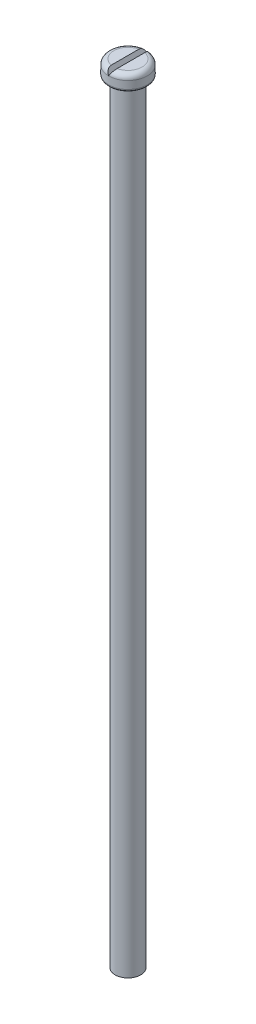
ISO-10303-21;
HEADER;
FILE_DESCRIPTION(('STEP AP214'),'2;1');
FILE_NAME('part.step','',(''),(''),'','','');
FILE_SCHEMA(('AUTOMOTIVE_DESIGN { 1 0 10303 214 1 1 1 1 }'));
ENDSEC;
DATA;
#1=APPLICATION_CONTEXT('core data for automotive mechanical design processes');
#2=APPLICATION_PROTOCOL_DEFINITION('international standard','automotive_design',2000,#1);
#3=PRODUCT_CONTEXT('',#1,'mechanical');
#4=PRODUCT('Part','Part','',(#3));
#5=PRODUCT_RELATED_PRODUCT_CATEGORY('part','',(#4));
#6=PRODUCT_DEFINITION_FORMATION('','',#4);
#7=PRODUCT_DEFINITION_CONTEXT('part definition',#1,'design');
#8=PRODUCT_DEFINITION('design','',#6,#7);
#9=PRODUCT_DEFINITION_SHAPE('','',#8);
#10=(LENGTH_UNIT() NAMED_UNIT(*) SI_UNIT(.MILLI.,.METRE.));
#11=(NAMED_UNIT(*) PLANE_ANGLE_UNIT() SI_UNIT($,.RADIAN.));
#12=(NAMED_UNIT(*) SI_UNIT($,.STERADIAN.) SOLID_ANGLE_UNIT());
#13=UNCERTAINTY_MEASURE_WITH_UNIT(LENGTH_MEASURE(1.E-05),#10,'distance_accuracy_value','');
#14=(GEOMETRIC_REPRESENTATION_CONTEXT(3) GLOBAL_UNCERTAINTY_ASSIGNED_CONTEXT((#13)) GLOBAL_UNIT_ASSIGNED_CONTEXT((#10,
#11,#12)) REPRESENTATION_CONTEXT('',''));
#15=CARTESIAN_POINT('',(0.,0.,0.));
#16=DIRECTION('',(0.,0.,1.));
#17=DIRECTION('',(1.,0.,0.));
#18=AXIS2_PLACEMENT_3D('',#15,#16,#17);
#19=CARTESIAN_POINT('',(0.,153.,0.));
#20=DIRECTION('',(0.,1.,0.));
#21=DIRECTION('',(0.,0.,1.));
#22=AXIS2_PLACEMENT_3D('',#19,#20,#21);
#23=PLANE('',#22);
#24=CARTESIAN_POINT('',(0.,153.,0.));
#25=DIRECTION('',(0.,1.,0.));
#26=DIRECTION('',(0.,0.,1.));
#27=AXIS2_PLACEMENT_3D('',#24,#25,#26);
#28=CIRCLE('',#27,2.75);
#29=CARTESIAN_POINT('',(0.577350269189633,153.,2.68871096748361));
#30=VERTEX_POINT('',#29);
#31=CARTESIAN_POINT('',(0.577350269189633,153.,-2.68871096748361));
#32=VERTEX_POINT('',#31);
#33=EDGE_CURVE('E86',#30,#32,#28,.T.);
#34=ORIENTED_EDGE('',*,*,#33,.T.);
#35=DIRECTION('',(0.,0.,-1.));
#36=VECTOR('',#35,1.);
#37=CARTESIAN_POINT('',(0.577350269189633,153.,10.));
#38=LINE('',#37,#36);
#39=EDGE_CURVE('E55',#30,#32,#38,.T.);
#40=ORIENTED_EDGE('',*,*,#39,.F.);
#41=EDGE_LOOP('',(#34,#40));
#42=FACE_BOUND('',#41,.T.);
#43=ADVANCED_FACE('F33',(#42),#23,.T.);
#44=CARTESIAN_POINT('',(-0.577350269189633,153.,-2.68871096748362));
#45=VERTEX_POINT('',#44);
#46=CARTESIAN_POINT('',(-0.577350269189633,153.,2.68871096748361));
#47=VERTEX_POINT('',#46);
#48=EDGE_CURVE('E79',#45,#47,#28,.T.);
#49=ORIENTED_EDGE('',*,*,#48,.T.);
#50=DIRECTION('',(0.,0.,-1.));
#51=VECTOR('',#50,1.);
#52=CARTESIAN_POINT('',(-0.577350269189633,153.,10.));
#53=LINE('',#52,#51);
#54=EDGE_CURVE('E66',#47,#45,#53,.T.);
#55=ORIENTED_EDGE('',*,*,#54,.T.);
#56=EDGE_LOOP('',(#49,#55));
#57=FACE_BOUND('',#56,.T.);
#58=ADVANCED_FACE('F85',(#57),#23,.T.);
#59=CARTESIAN_POINT('',(0.,152.,0.));
#60=DIRECTION('',(0.,1.,0.));
#61=DIRECTION('',(0.,0.,1.));
#62=AXIS2_PLACEMENT_3D('',#59,#60,#61);
#63=TOROIDAL_SURFACE('',#62,2.75,1.);
#64=ORIENTED_EDGE('',*,*,#33,.F.);
#65=CARTESIAN_POINT('',(-0.000115470053841142,151.9998,1.75000001619048));
#66=CARTESIAN_POINT('',(0.0209484655551252,152.036283806682,1.75001085956885));
#67=CARTESIAN_POINT('',(0.0420172013686741,152.072775927562,1.75160544013414));
#68=CARTESIAN_POINT('',(0.08406750960041,152.145609197894,1.75808927161738));
#69=CARTESIAN_POINT('',(0.105048835581679,152.181949920503,1.76298487009));
#70=CARTESIAN_POINT('',(0.146971876057755,152.254562756616,1.77627065487943));
#71=CARTESIAN_POINT('',(0.167910680972026,152.290829830577,1.78469824833808));
#72=CARTESIAN_POINT('',(0.209309329480201,152.362534393158,1.80526918971544));
#73=CARTESIAN_POINT('',(0.229769554863219,152.397972543056,1.8174094588678));
#74=CARTESIAN_POINT('',(0.277689771058094,152.480972792215,1.85109292101));
#75=CARTESIAN_POINT('',(0.304841154419377,152.528000367692,1.87445642646166));
#76=CARTESIAN_POINT('',(0.356892937282951,152.618156700237,1.92941289798607));
#77=CARTESIAN_POINT('',(0.38180073627445,152.661298273595,1.96097737007163));
#78=CARTESIAN_POINT('',(0.428665053750137,152.742469652524,2.03303956886826));
#79=CARTESIAN_POINT('',(0.450583856027887,152.780434131711,2.0736369754288));
#80=CARTESIAN_POINT('',(0.489901599435792,152.848534460932,2.16285510950786));
#81=CARTESIAN_POINT('',(0.507302879597329,152.878674362289,2.21147166355223));
#82=CARTESIAN_POINT('',(0.534369747704999,152.925555553053,2.30697260930815));
#83=CARTESIAN_POINT('',(0.544811559085812,152.943641300887,2.35298390736476));
#84=CARTESIAN_POINT('',(0.561444100561424,152.972449707782,2.44797834834081));
#85=CARTESIAN_POINT('',(0.56763549302068,152.983173514091,2.49696102691945));
#86=CARTESIAN_POINT('',(0.575488929232366,152.996776064624,2.59377396776612));
#87=CARTESIAN_POINT('',(0.577365189618826,153.000025842941,2.64153626462796));
#88=CARTESIAN_POINT('',(0.577335164292318,152.99997383755,2.73704202890096));
#89=CARTESIAN_POINT('',(0.575428632668017,152.996671627911,2.78478549488616));
#90=CARTESIAN_POINT('',(0.567810163854552,152.98347605285,2.8821588327198));
#91=CARTESIAN_POINT('',(0.56186307914217,152.973175399971,2.93171457498444));
#92=CARTESIAN_POINT('',(0.546264204560442,152.946157356655,3.02843011891978));
#93=CARTESIAN_POINT('',(0.536610946898149,152.929437423925,3.0755889629328));
#94=CARTESIAN_POINT('',(0.512874483672331,152.888324663626,3.17098620294368));
#95=CARTESIAN_POINT('',(0.498453199871364,152.863346267372,3.21888811224706));
#96=CARTESIAN_POINT('',(0.466115657353585,152.80733600074,3.30970515485604));
#97=CARTESIAN_POINT('',(0.448198176296832,152.776302013206,3.35261853567545));
#98=CARTESIAN_POINT('',(0.407614269888646,152.706008625337,3.43632760476896));
#99=CARTESIAN_POINT('',(0.384663696646262,152.666257066419,3.4765727477869));
#100=CARTESIAN_POINT('',(0.335893467218433,152.581784551153,3.54939048999603));
#101=CARTESIAN_POINT('',(0.310072432553336,152.537061207209,3.58195937919646));
#102=CARTESIAN_POINT('',(0.254374891317378,152.440590235932,3.6407859698484));
#103=CARTESIAN_POINT('',(0.224341288931661,152.388570510665,3.66644859373228));
#104=CARTESIAN_POINT('',(0.162612009472907,152.281652262328,3.70776295620746));
#105=CARTESIAN_POINT('',(0.130917397631563,152.226755584293,3.72342102788772));
#106=CARTESIAN_POINT('',(0.0824635065171768,152.142830983058,3.73929371903051));
#107=CARTESIAN_POINT('',(0.0659947762769646,152.114306305546,3.74331612080812));
#108=CARTESIAN_POINT('',(0.0329810075382238,152.057124780741,3.74866943119802));
#109=CARTESIAN_POINT('',(0.0164361839319631,152.028468305653,3.75000563878057));
#110=CARTESIAN_POINT('',(-0.000115470053837213,151.9998,3.7499999782223));
#111=B_SPLINE_CURVE_WITH_KNOTS('',3,(#65,#66,#67,#68,#69,#70,#71,#72,#73,#74,#75,#76,#77,#78,
#79,#80,#81,#82,#83,#84,#85,#86,#87,#88,#89,#90,#91,#92,#93,#94,#95,#96,#97,#98,#99,#100,#101,
#102,#103,#104,#105,#106,#107,#108,#109,#110),.UNSPECIFIED.,.F.,.F.,(4,2,2,2,2,2,2,2,2,2,2,2,2,
2,2,2,2,2,2,2,2,2,4),(0.,0.126368028671535,0.25297974706964,0.380967713199966,0.508849830759628,
0.685536653031699,0.861617606551809,1.03974757158058,1.21778512171644,1.36858225517138,
1.5193558838023,1.66246621191694,1.8055858436371,1.9578414526995,2.11015742338722,
2.27720049589411,2.44430207495475,2.62665141889002,2.8090887137285,3.00419082232551,
3.19916930456234,3.29862059646818,3.39787551068638),.UNSPECIFIED.);
#112=CARTESIAN_POINT('',(0.,152.,3.75));
#113=VERTEX_POINT('',#112);
#114=EDGE_CURVE('E82',#30,#113,#111,.T.);
#115=ORIENTED_EDGE('',*,*,#114,.T.);
#116=CARTESIAN_POINT('',(0.,152.,0.));
#117=DIRECTION('',(0.,1.,0.));
#118=DIRECTION('',(0.,0.,1.));
#119=AXIS2_PLACEMENT_3D('',#116,#117,#118);
#120=CIRCLE('',#119,3.75);
#121=CARTESIAN_POINT('',(0.,152.,-3.75));
#122=VERTEX_POINT('',#121);
#123=EDGE_CURVE('E90',#122,#113,#120,.F.);
#124=ORIENTED_EDGE('',*,*,#123,.F.);
#125=CARTESIAN_POINT('',(-0.000115470053841247,151.9998,-3.74999997822222));
#126=CARTESIAN_POINT('',(0.0340384252611943,152.058956281962,-3.75005660942029));
#127=CARTESIAN_POINT('',(0.0681930814106098,152.118113881728,-3.74431173427567));
#128=CARTESIAN_POINT('',(0.135570303553001,152.234814653751,-3.72152223450687));
#129=CARTESIAN_POINT('',(0.16879222068131,152.292356702142,-3.70446993736152));
#130=CARTESIAN_POINT('',(0.233349820905158,152.404173745745,-3.65934972519742));
#131=CARTESIAN_POINT('',(0.264683814013755,152.458445813813,-3.63127210493293));
#132=CARTESIAN_POINT('',(0.324457401550758,152.561976704378,-3.56474977822805));
#133=CARTESIAN_POINT('',(0.35289844015485,152.61123802826,-3.52631027981403));
#134=CARTESIAN_POINT('',(0.405271378137289,152.701950617787,-3.44104873225281));
#135=CARTESIAN_POINT('',(0.429298515404751,152.743566840295,-3.394461224206));
#136=CARTESIAN_POINT('',(0.472808848314608,152.818928947549,-3.2934135467998));
#137=CARTESIAN_POINT('',(0.492292264601939,152.852675214464,-3.23895375992961));
#138=CARTESIAN_POINT('',(0.524803809009096,152.908986861209,-3.12717807079762));
#139=CARTESIAN_POINT('',(0.538151419703191,152.932105601091,-3.07023488078048));
#140=CARTESIAN_POINT('',(0.559329068204868,152.968786364281,-2.95236595258503));
#141=CARTESIAN_POINT('',(0.567162654739825,152.982354534165,-2.89144280348183));
#142=CARTESIAN_POINT('',(0.576240209108803,152.998077319541,-2.77346020141678));
#143=CARTESIAN_POINT('',(0.578030147594193,153.00117758394,-2.71656964442777));
#144=CARTESIAN_POINT('',(0.576209336298232,152.998023846264,-2.60313786456695));
#145=CARTESIAN_POINT('',(0.572603672358546,152.991778653126,-2.54659636310586));
#146=CARTESIAN_POINT('',(0.560569012048558,152.970934010017,-2.44187821523171));
#147=CARTESIAN_POINT('',(0.552688634646429,152.957284795973,-2.39344815875947));
#148=CARTESIAN_POINT('',(0.532705027374284,152.92267217286,-2.30022211374278));
#149=CARTESIAN_POINT('',(0.520603864134791,152.901712343298,-2.25542435991365));
#150=CARTESIAN_POINT('',(0.493468898616936,152.85471320436,-2.17341750325088));
#151=CARTESIAN_POINT('',(0.478656306784737,152.829057042714,-2.13591350893716));
#152=CARTESIAN_POINT('',(0.446239078395953,152.772908756104,-2.06612827244175));
#153=CARTESIAN_POINT('',(0.42863449498769,152.742416723195,-2.03384693086532));
#154=CARTESIAN_POINT('',(0.390238415727691,152.675912763106,-1.97325037486977));
#155=CARTESIAN_POINT('',(0.369326139560134,152.639691638281,-1.94524359133165));
#156=CARTESIAN_POINT('',(0.325754050068556,152.56422256549,-1.8953069834418));
#157=CARTESIAN_POINT('',(0.303092119624438,152.524970950563,-1.87338467353986));
#158=CARTESIAN_POINT('',(0.243514128332367,152.421778842633,-1.82453894685715));
#159=CARTESIAN_POINT('',(0.205752669469103,152.356374077313,-1.80174256517128));
#160=CARTESIAN_POINT('',(0.128930463973443,152.223314114245,-1.76845680614801));
#161=CARTESIAN_POINT('',(0.0898690065927526,152.155657685444,-1.75797427872601));
#162=CARTESIAN_POINT('',(0.0422141394206663,152.073117034274,-1.75208078392321));
#163=CARTESIAN_POINT('',(0.03374071955033,152.058440640545,-1.75129675458104));
#164=CARTESIAN_POINT('',(0.0168070964070089,152.029110744905,-1.75025564539774));
#165=CARTESIAN_POINT('',(0.00834691341939388,152.014457278129,-1.74999724650461));
#166=CARTESIAN_POINT('',(-0.000115470053839954,151.9998,-1.75000001619048));
#167=B_SPLINE_CURVE_WITH_KNOTS('',3,(#125,#126,#127,#128,#129,#130,#131,#132,#133,#134,#135,
#136,#137,#138,#139,#140,#141,#142,#143,#144,#145,#146,#147,#148,#149,#150,#151,#152,#153,#154,
#155,#156,#157,#158,#159,#160,#161,#162,#163,#164,#165,#166),.UNSPECIFIED.,.F.,.F.,(4,2,2,2,2,2,
2,2,2,2,2,2,2,2,2,2,2,2,2,2,4),(0.,0.204685243967307,0.409509517067552,0.614514496191856,
0.819416628419386,1.0191772708235,1.21892821074888,1.40658194027588,1.594114788521,
1.76417459842209,1.93407421256061,2.08606081358211,2.2379731013719,2.38071223540546,
2.52344865258449,2.67389528043641,2.82452689444772,3.05991791196452,3.29543981020444,
3.34633105855997,3.39709443869585),.UNSPECIFIED.);
#168=EDGE_CURVE('E83',#122,#32,#167,.T.);
#169=ORIENTED_EDGE('',*,*,#168,.T.);
#170=EDGE_LOOP('',(#64,#115,#124,#169));
#171=FACE_BOUND('',#170,.T.);
#172=ADVANCED_FACE('F106',(#171),#63,.T.);
#173=EDGE_CURVE('E81',#113,#122,#120,.F.);
#174=ORIENTED_EDGE('',*,*,#173,.F.);
#175=CARTESIAN_POINT('',(0.000115470053841247,151.9998,3.74999997822222));
#176=CARTESIAN_POINT('',(-0.0340384252611942,152.058956281962,3.75005660942029));
#177=CARTESIAN_POINT('',(-0.0681930814106097,152.118113881728,3.74431173427567));
#178=CARTESIAN_POINT('',(-0.135570303553001,152.234814653751,3.72152223450687));
#179=CARTESIAN_POINT('',(-0.16879222068131,152.292356702142,3.70446993736152));
#180=CARTESIAN_POINT('',(-0.233349820905158,152.404173745745,3.65934972519742));
#181=CARTESIAN_POINT('',(-0.264683814013755,152.458445813813,3.63127210493293));
#182=CARTESIAN_POINT('',(-0.324457401550757,152.561976704378,3.56474977822805));
#183=CARTESIAN_POINT('',(-0.352898440154849,152.61123802826,3.52631027981403));
#184=CARTESIAN_POINT('',(-0.405271378137289,152.701950617787,3.44104873225281));
#185=CARTESIAN_POINT('',(-0.429298515404751,152.743566840295,3.394461224206));
#186=CARTESIAN_POINT('',(-0.472808848314608,152.818928947549,3.2934135467998));
#187=CARTESIAN_POINT('',(-0.492292264601938,152.852675214464,3.23895375992961));
#188=CARTESIAN_POINT('',(-0.524803809009096,152.908986861209,3.12717807079762));
#189=CARTESIAN_POINT('',(-0.538151419703191,152.932105601091,3.07023488078048));
#190=CARTESIAN_POINT('',(-0.559329068204867,152.968786364281,2.95236595258503));
#191=CARTESIAN_POINT('',(-0.567162654739825,152.982354534165,2.89144280348183));
#192=CARTESIAN_POINT('',(-0.576240209108803,152.998077319541,2.77346020141678));
#193=CARTESIAN_POINT('',(-0.578030147594193,153.00117758394,2.71656964442777));
#194=CARTESIAN_POINT('',(-0.576209336298232,152.998023846264,2.60313786456695));
#195=CARTESIAN_POINT('',(-0.572603672358545,152.991778653126,2.54659636310586));
#196=CARTESIAN_POINT('',(-0.560569012048558,152.970934010017,2.44187821523171));
#197=CARTESIAN_POINT('',(-0.552688634646428,152.957284795973,2.39344815875947));
#198=CARTESIAN_POINT('',(-0.532705027374283,152.92267217286,2.30022211374278));
#199=CARTESIAN_POINT('',(-0.52060386413479,152.901712343298,2.25542435991365));
#200=CARTESIAN_POINT('',(-0.493468898616936,152.85471320436,2.17341750325088));
#201=CARTESIAN_POINT('',(-0.478656306784736,152.829057042714,2.13591350893716));
#202=CARTESIAN_POINT('',(-0.446239078395953,152.772908756104,2.06612827244175));
#203=CARTESIAN_POINT('',(-0.42863449498769,152.742416723195,2.03384693086532));
#204=CARTESIAN_POINT('',(-0.390238415727686,152.675912763106,1.97325037486977));
#205=CARTESIAN_POINT('',(-0.369326139560122,152.639691638281,1.94524359133163));
#206=CARTESIAN_POINT('',(-0.325754050068543,152.56422256549,1.89530698344179));
#207=CARTESIAN_POINT('',(-0.303092119624431,152.524970950563,1.87338467353986));
#208=CARTESIAN_POINT('',(-0.243514128332367,152.421778842633,1.82453894685715));
#209=CARTESIAN_POINT('',(-0.205752669469104,152.356374077313,1.80174256517128));
#210=CARTESIAN_POINT('',(-0.128930463973443,152.223314114245,1.76845680614801));
#211=CARTESIAN_POINT('',(-0.0898690065927525,152.155657685444,1.75797427872601));
#212=CARTESIAN_POINT('',(-0.0422141394206662,152.073117034274,1.75208078392321));
#213=CARTESIAN_POINT('',(-0.03374071955033,152.058440640545,1.75129675458104));
#214=CARTESIAN_POINT('',(-0.0168070964070089,152.029110744905,1.75025564539774));
#215=CARTESIAN_POINT('',(-0.00834691341939391,152.014457278129,1.74999724650461));
#216=CARTESIAN_POINT('',(0.000115470053839956,151.9998,1.75000001619048));
#217=B_SPLINE_CURVE_WITH_KNOTS('',3,(#175,#176,#177,#178,#179,#180,#181,#182,#183,#184,#185,
#186,#187,#188,#189,#190,#191,#192,#193,#194,#195,#196,#197,#198,#199,#200,#201,#202,#203,#204,
#205,#206,#207,#208,#209,#210,#211,#212,#213,#214,#215,#216),.UNSPECIFIED.,.F.,.F.,(4,2,2,2,2,2,
2,2,2,2,2,2,2,2,2,2,2,2,2,2,4),(0.,0.204685243967307,0.409509517067552,0.614514496191856,
0.819416628419386,1.0191772708235,1.21892821074888,1.40658194027588,1.594114788521,
1.76417459842209,1.93407421256061,2.08606081358211,2.2379731013719,2.38071223540546,
2.52344865258449,2.67389528043645,2.82452689444772,3.05991791196452,3.29543981020444,
3.34633105855997,3.39709443869585),.UNSPECIFIED.);
#218=EDGE_CURVE('E69',#113,#47,#217,.T.);
#219=ORIENTED_EDGE('',*,*,#218,.T.);
#220=ORIENTED_EDGE('',*,*,#48,.F.);
#221=CARTESIAN_POINT('',(0.000115470053841142,151.9998,-1.75000001619048));
#222=CARTESIAN_POINT('',(-0.0209484655551159,152.036283806682,-1.75001085956885));
#223=CARTESIAN_POINT('',(-0.0420172013686674,152.072775927562,-1.75160544013413));
#224=CARTESIAN_POINT('',(-0.0840675096004087,152.145609197894,-1.75808927161738));
#225=CARTESIAN_POINT('',(-0.10504883558168,152.181949920503,-1.76298487009));
#226=CARTESIAN_POINT('',(-0.146971876057758,152.254562756616,-1.77627065487943));
#227=CARTESIAN_POINT('',(-0.167910680972027,152.290829830577,-1.78469824833808));
#228=CARTESIAN_POINT('',(-0.209309329480201,152.362534393158,-1.80526918971544));
#229=CARTESIAN_POINT('',(-0.229769554863219,152.397972543056,-1.8174094588678));
#230=CARTESIAN_POINT('',(-0.277689771058094,152.480972792215,-1.85109292101));
#231=CARTESIAN_POINT('',(-0.304841154419377,152.528000367692,-1.87445642646166));
#232=CARTESIAN_POINT('',(-0.356892937282951,152.618156700237,-1.92941289798607));
#233=CARTESIAN_POINT('',(-0.38180073627445,152.661298273595,-1.96097737007163));
#234=CARTESIAN_POINT('',(-0.428665053750137,152.742469652524,-2.03303956886826));
#235=CARTESIAN_POINT('',(-0.450583856027887,152.780434131711,-2.0736369754288));
#236=CARTESIAN_POINT('',(-0.489901599435792,152.848534460932,-2.16285510950786));
#237=CARTESIAN_POINT('',(-0.507302879597329,152.878674362289,-2.21147166355223));
#238=CARTESIAN_POINT('',(-0.534369747704998,152.925555553053,-2.30697260930815));
#239=CARTESIAN_POINT('',(-0.544811559085812,152.943641300887,-2.35298390736475));
#240=CARTESIAN_POINT('',(-0.561444100561423,152.972449707782,-2.44797834834081));
#241=CARTESIAN_POINT('',(-0.56763549302068,152.983173514091,-2.49696102691945));
#242=CARTESIAN_POINT('',(-0.575488929232366,152.996776064624,-2.59377396776612));
#243=CARTESIAN_POINT('',(-0.577365189618826,153.000025842941,-2.64153626462796));
#244=CARTESIAN_POINT('',(-0.577335164292318,152.99997383755,-2.73704202890096));
#245=CARTESIAN_POINT('',(-0.575428632668017,152.996671627911,-2.78478549488616));
#246=CARTESIAN_POINT('',(-0.567810163854551,152.98347605285,-2.88215883271979));
#247=CARTESIAN_POINT('',(-0.56186307914217,152.973175399971,-2.93171457498443));
#248=CARTESIAN_POINT('',(-0.546264204560442,152.946157356655,-3.02843011891978));
#249=CARTESIAN_POINT('',(-0.53661094689815,152.929437423925,-3.0755889629328));
#250=CARTESIAN_POINT('',(-0.51287448367233,152.888324663626,-3.17098620294368));
#251=CARTESIAN_POINT('',(-0.498453199871364,152.863346267372,-3.21888811224706));
#252=CARTESIAN_POINT('',(-0.466115657353585,152.80733600074,-3.30970515485604));
#253=CARTESIAN_POINT('',(-0.448198176296832,152.776302013206,-3.35261853567545));
#254=CARTESIAN_POINT('',(-0.407614269888646,152.706008625337,-3.43632760476896));
#255=CARTESIAN_POINT('',(-0.384663696646262,152.666257066419,-3.4765727477869));
#256=CARTESIAN_POINT('',(-0.335893467218432,152.581784551153,-3.54939048999603));
#257=CARTESIAN_POINT('',(-0.310072432553336,152.537061207209,-3.58195937919646));
#258=CARTESIAN_POINT('',(-0.254374891317378,152.440590235932,-3.6407859698484));
#259=CARTESIAN_POINT('',(-0.224341288931662,152.388570510665,-3.66644859373228));
#260=CARTESIAN_POINT('',(-0.162612009472906,152.281652262328,-3.70776295620746));
#261=CARTESIAN_POINT('',(-0.130917397631562,152.226755584293,-3.72342102788772));
#262=CARTESIAN_POINT('',(-0.0824635065171727,152.142830983058,-3.73929371903051));
#263=CARTESIAN_POINT('',(-0.065994776276957,152.114306305546,-3.74331612080812));
#264=CARTESIAN_POINT('',(-0.0329810075382173,152.057124780741,-3.74866943119802));
#265=CARTESIAN_POINT('',(-0.0164361839319613,152.028468305653,-3.75000563878057));
#266=CARTESIAN_POINT('',(0.000115470053837213,151.9998,-3.7499999782223));
#267=B_SPLINE_CURVE_WITH_KNOTS('',3,(#221,#222,#223,#224,#225,#226,#227,#228,#229,#230,#231,
#232,#233,#234,#235,#236,#237,#238,#239,#240,#241,#242,#243,#244,#245,#246,#247,#248,#249,#250,
#251,#252,#253,#254,#255,#256,#257,#258,#259,#260,#261,#262,#263,#264,#265,#266),.UNSPECIFIED.,
.F.,.F.,(4,2,2,2,2,2,2,2,2,2,2,2,2,2,2,2,2,2,2,2,2,2,4),(0.,0.126368028671559,0.25297974706964,
0.380967713199966,0.508849830759628,0.6855366530317,0.861617606551809,1.03974757158058,
1.21778512171644,1.36858225517138,1.5193558838023,1.66246621191694,1.8055858436371,
1.95784145269949,2.11015742338722,2.27720049589411,2.44430207495475,2.62665141889002,
2.8090887137285,3.00419082232551,3.19916930456234,3.29862059646821,3.39787551068638),.UNSPECIFIED.);
#268=EDGE_CURVE('E71',#45,#122,#267,.T.);
#269=ORIENTED_EDGE('',*,*,#268,.T.);
#270=EDGE_LOOP('',(#174,#219,#220,#269));
#271=FACE_BOUND('',#270,.T.);
#272=ADVANCED_FACE('F78',(#271),#63,.T.);
#273=CARTESIAN_POINT('',(0.,150.,0.));
#274=DIRECTION('',(0.,-1.,0.));
#275=DIRECTION('',(0.,0.,-1.));
#276=AXIS2_PLACEMENT_3D('',#273,#274,#275);
#277=CYLINDRICAL_SURFACE('',#276,2.5);
#278=CARTESIAN_POINT('',(0.,150.,0.));
#279=DIRECTION('',(0.,1.,0.));
#280=DIRECTION('',(0.,0.,1.));
#281=AXIS2_PLACEMENT_3D('',#278,#279,#280);
#282=CIRCLE('',#281,2.5);
#283=CARTESIAN_POINT('',(0.,150.,2.5));
#284=VERTEX_POINT('',#283);
#285=EDGE_CURVE('E87',#284,#284,#282,.T.);
#286=ORIENTED_EDGE('',*,*,#285,.F.);
#287=EDGE_LOOP('',(#286));
#288=FACE_BOUND('',#287,.T.);
#289=CARTESIAN_POINT('',(0.,0.,0.));
#290=DIRECTION('',(0.,1.,0.));
#291=DIRECTION('',(0.,0.,1.));
#292=AXIS2_PLACEMENT_3D('',#289,#290,#291);
#293=CIRCLE('',#292,2.5);
#294=CARTESIAN_POINT('',(0.,0.,2.5));
#295=VERTEX_POINT('',#294);
#296=EDGE_CURVE('E92',#295,#295,#293,.T.);
#297=ORIENTED_EDGE('',*,*,#296,.T.);
#298=EDGE_LOOP('',(#297));
#299=FACE_BOUND('',#298,.T.);
#300=ADVANCED_FACE('F148',(#288,#299),#277,.T.);
#301=CARTESIAN_POINT('',(0.,0.,0.));
#302=DIRECTION('',(0.,1.,0.));
#303=DIRECTION('',(0.,0.,1.));
#304=AXIS2_PLACEMENT_3D('',#301,#302,#303);
#305=PLANE('',#304);
#306=ORIENTED_EDGE('',*,*,#296,.F.);
#307=EDGE_LOOP('',(#306));
#308=FACE_BOUND('',#307,.T.);
#309=ADVANCED_FACE('F144',(#308),#305,.F.);
#310=CARTESIAN_POINT('',(0.,150.,0.));
#311=DIRECTION('',(0.,1.,0.));
#312=DIRECTION('',(0.,0.,1.));
#313=AXIS2_PLACEMENT_3D('',#310,#311,#312);
#314=PLANE('',#313);
#315=CARTESIAN_POINT('',(0.,150.,0.));
#316=DIRECTION('',(0.,1.,0.));
#317=DIRECTION('',(0.,0.,1.));
#318=AXIS2_PLACEMENT_3D('',#315,#316,#317);
#319=CIRCLE('',#318,3.25);
#320=CARTESIAN_POINT('',(0.,150.,3.25));
#321=VERTEX_POINT('',#320);
#322=EDGE_CURVE('E11',#321,#321,#319,.F.);
#323=ORIENTED_EDGE('',*,*,#322,.T.);
#324=EDGE_LOOP('',(#323));
#325=FACE_BOUND('',#324,.T.);
#326=ORIENTED_EDGE('',*,*,#285,.T.);
#327=EDGE_LOOP('',(#326));
#328=FACE_BOUND('',#327,.T.);
#329=ADVANCED_FACE('F141',(#325,#328),#314,.F.);
#330=CARTESIAN_POINT('',(0.,153.,0.));
#331=DIRECTION('',(0.,-1.,0.));
#332=DIRECTION('',(0.,0.,-1.));
#333=AXIS2_PLACEMENT_3D('',#330,#331,#332);
#334=CYLINDRICAL_SURFACE('',#333,3.75);
#335=CARTESIAN_POINT('',(0.,150.5,0.));
#336=DIRECTION('',(0.,1.,0.));
#337=DIRECTION('',(0.,0.,1.));
#338=AXIS2_PLACEMENT_3D('',#335,#336,#337);
#339=CIRCLE('',#338,3.75);
#340=CARTESIAN_POINT('',(0.,150.5,3.75));
#341=VERTEX_POINT('',#340);
#342=EDGE_CURVE('E41',#341,#341,#339,.T.);
#343=ORIENTED_EDGE('',*,*,#342,.T.);
#344=EDGE_LOOP('',(#343));
#345=FACE_BOUND('',#344,.T.);
#346=ORIENTED_EDGE('',*,*,#173,.T.);
#347=ORIENTED_EDGE('',*,*,#123,.T.);
#348=EDGE_LOOP('',(#346,#347));
#349=FACE_BOUND('',#348,.T.);
#350=ADVANCED_FACE('F126',(#345,#349),#334,.T.);
#351=CARTESIAN_POINT('',(0.,152.,10.));
#352=DIRECTION('',(-0.866025403784436,0.500000000000005,0.));
#353=DIRECTION('',(-0.500000000000005,-0.866025403784436,0.));
#354=AXIS2_PLACEMENT_3D('',#351,#352,#353);
#355=PLANE('',#354);
#356=ORIENTED_EDGE('',*,*,#39,.T.);
#357=ORIENTED_EDGE('',*,*,#168,.F.);
#358=DIRECTION('',(0.,0.,-1.));
#359=VECTOR('',#358,1.);
#360=CARTESIAN_POINT('',(0.,152.,10.));
#361=LINE('',#360,#359);
#362=EDGE_CURVE('E48',#113,#122,#361,.T.);
#363=ORIENTED_EDGE('',*,*,#362,.F.);
#364=ORIENTED_EDGE('',*,*,#114,.F.);
#365=EDGE_LOOP('',(#356,#357,#363,#364));
#366=FACE_BOUND('',#365,.T.);
#367=ADVANCED_FACE('F111',(#366),#355,.T.);
#368=CARTESIAN_POINT('',(0.,152.,10.));
#369=DIRECTION('',(0.866025403784436,0.500000000000004,0.));
#370=DIRECTION('',(-0.500000000000004,0.866025403784436,0.));
#371=AXIS2_PLACEMENT_3D('',#368,#369,#370);
#372=PLANE('',#371);
#373=ORIENTED_EDGE('',*,*,#362,.T.);
#374=ORIENTED_EDGE('',*,*,#268,.F.);
#375=ORIENTED_EDGE('',*,*,#54,.F.);
#376=ORIENTED_EDGE('',*,*,#218,.F.);
#377=EDGE_LOOP('',(#373,#374,#375,#376));
#378=FACE_BOUND('',#377,.T.);
#379=ADVANCED_FACE('F68',(#378),#372,.T.);
#380=CARTESIAN_POINT('',(0.,150.5,0.));
#381=DIRECTION('',(0.,1.,0.));
#382=DIRECTION('',(0.,0.,1.));
#383=AXIS2_PLACEMENT_3D('',#380,#381,#382);
#384=TOROIDAL_SURFACE('',#383,3.25,0.5);
#385=ORIENTED_EDGE('',*,*,#322,.F.);
#386=EDGE_LOOP('',(#385));
#387=FACE_BOUND('',#386,.T.);
#388=ORIENTED_EDGE('',*,*,#342,.F.);
#389=EDGE_LOOP('',(#388));
#390=FACE_BOUND('',#389,.T.);
#391=ADVANCED_FACE('F35',(#387,#390),#384,.T.);
#392=CLOSED_SHELL('',(#43,#58,#172,#272,#300,#309,#329,#350,#367,#379,#391));
#393=MANIFOLD_SOLID_BREP('B2',#392);
#394=ADVANCED_BREP_SHAPE_REPRESENTATION('',(#18,#393),#14);
#395=SHAPE_DEFINITION_REPRESENTATION(#9,#394);
ENDSEC;
END-ISO-10303-21;
